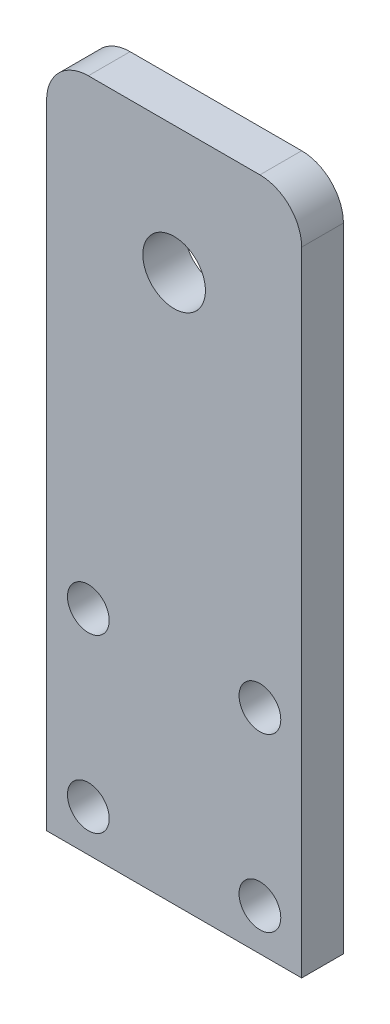
ISO-10303-21;
HEADER;
FILE_DESCRIPTION(('STEP AP214'),'2;1');
FILE_NAME('part.step','',(''),(''),'','','');
FILE_SCHEMA(('AUTOMOTIVE_DESIGN { 1 0 10303 214 1 1 1 1 }'));
ENDSEC;
DATA;
#1=APPLICATION_CONTEXT('core data for automotive mechanical design processes');
#2=APPLICATION_PROTOCOL_DEFINITION('international standard','automotive_design',2000,#1);
#3=PRODUCT_CONTEXT('',#1,'mechanical');
#4=PRODUCT('Part','Part','',(#3));
#5=PRODUCT_RELATED_PRODUCT_CATEGORY('part','',(#4));
#6=PRODUCT_DEFINITION_FORMATION('','',#4);
#7=PRODUCT_DEFINITION_CONTEXT('part definition',#1,'design');
#8=PRODUCT_DEFINITION('design','',#6,#7);
#9=PRODUCT_DEFINITION_SHAPE('','',#8);
#10=(LENGTH_UNIT() NAMED_UNIT(*) SI_UNIT(.MILLI.,.METRE.));
#11=(NAMED_UNIT(*) PLANE_ANGLE_UNIT() SI_UNIT($,.RADIAN.));
#12=(NAMED_UNIT(*) SI_UNIT($,.STERADIAN.) SOLID_ANGLE_UNIT());
#13=UNCERTAINTY_MEASURE_WITH_UNIT(LENGTH_MEASURE(1.E-05),#10,'distance_accuracy_value','');
#14=(GEOMETRIC_REPRESENTATION_CONTEXT(3) GLOBAL_UNCERTAINTY_ASSIGNED_CONTEXT((#13)) GLOBAL_UNIT_ASSIGNED_CONTEXT((#10,
#11,#12)) REPRESENTATION_CONTEXT('',''));
#15=CARTESIAN_POINT('',(0.,0.,0.));
#16=DIRECTION('',(0.,0.,1.));
#17=DIRECTION('',(1.,0.,0.));
#18=AXIS2_PLACEMENT_3D('',#15,#16,#17);
#19=CARTESIAN_POINT('',(-19.4005200000629,0.,6.35));
#20=DIRECTION('',(1.,0.,0.));
#21=DIRECTION('',(0.,1.,0.));
#22=AXIS2_PLACEMENT_3D('',#19,#20,#21);
#23=PLANE('',#22);
#24=DIRECTION('',(0.,-1.,0.));
#25=VECTOR('',#24,1.);
#26=CARTESIAN_POINT('',(-19.4005200000629,0.,6.35));
#27=LINE('',#26,#25);
#28=CARTESIAN_POINT('',(-19.400520000063,76.8901025000322,6.35));
#29=VERTEX_POINT('',#28);
#30=CARTESIAN_POINT('',(-19.4005200000002,-19.4005200000001,6.35));
#31=VERTEX_POINT('',#30);
#32=EDGE_CURVE('E90',#29,#31,#27,.T.);
#33=ORIENTED_EDGE('',*,*,#32,.F.);
#34=DIRECTION('',(0.,0.,-1.));
#35=VECTOR('',#34,1.);
#36=CARTESIAN_POINT('',(-19.400520000063,76.8901025000322,6.35));
#37=LINE('',#36,#35);
#38=CARTESIAN_POINT('',(-19.400520000063,76.8901025000322,0.));
#39=VERTEX_POINT('',#38);
#40=EDGE_CURVE('E115',#29,#39,#37,.T.);
#41=ORIENTED_EDGE('',*,*,#40,.T.);
#42=DIRECTION('',(0.,-1.,0.));
#43=VECTOR('',#42,1.);
#44=CARTESIAN_POINT('',(-19.4005200000629,0.,0.));
#45=LINE('',#44,#43);
#46=CARTESIAN_POINT('',(-19.4005200000002,-19.4005200000001,0.));
#47=VERTEX_POINT('',#46);
#48=EDGE_CURVE('E113',#39,#47,#45,.T.);
#49=ORIENTED_EDGE('',*,*,#48,.T.);
#50=DIRECTION('',(0.,0.,-1.));
#51=VECTOR('',#50,1.);
#52=CARTESIAN_POINT('',(-19.4005200000002,-19.4005200000001,6.35));
#53=LINE('',#52,#51);
#54=EDGE_CURVE('E107',#31,#47,#53,.T.);
#55=ORIENTED_EDGE('',*,*,#54,.F.);
#56=EDGE_LOOP('',(#33,#41,#49,#55));
#57=FACE_BOUND('',#56,.T.);
#58=ADVANCED_FACE('F36',(#57),#23,.F.);
#59=CARTESIAN_POINT('',(1.38777878078143E-13,-19.40052,6.35));
#60=DIRECTION('',(0.,1.,0.));
#61=DIRECTION('',(-1.,0.,0.));
#62=AXIS2_PLACEMENT_3D('',#59,#60,#61);
#63=PLANE('',#62);
#64=DIRECTION('',(1.,0.,0.));
#65=VECTOR('',#64,1.);
#66=CARTESIAN_POINT('',(1.38777878078143E-13,-19.40052,0.));
#67=LINE('',#66,#65);
#68=CARTESIAN_POINT('',(19.4005200000002,-19.4005199999999,0.));
#69=VERTEX_POINT('',#68);
#70=EDGE_CURVE('E145',#47,#69,#67,.T.);
#71=ORIENTED_EDGE('',*,*,#70,.T.);
#72=DIRECTION('',(0.,0.,-1.));
#73=VECTOR('',#72,1.);
#74=CARTESIAN_POINT('',(19.4005200000002,-19.4005199999999,6.35));
#75=LINE('',#74,#73);
#76=CARTESIAN_POINT('',(19.4005200000002,-19.4005199999999,6.35));
#77=VERTEX_POINT('',#76);
#78=EDGE_CURVE('E109',#77,#69,#75,.T.);
#79=ORIENTED_EDGE('',*,*,#78,.F.);
#80=DIRECTION('',(1.,0.,0.));
#81=VECTOR('',#80,1.);
#82=CARTESIAN_POINT('',(1.38777878078143E-13,-19.40052,6.35));
#83=LINE('',#82,#81);
#84=EDGE_CURVE('E94',#31,#77,#83,.T.);
#85=ORIENTED_EDGE('',*,*,#84,.F.);
#86=ORIENTED_EDGE('',*,*,#54,.T.);
#87=EDGE_LOOP('',(#71,#79,#85,#86));
#88=FACE_BOUND('',#87,.T.);
#89=ADVANCED_FACE('F106',(#88),#63,.F.);
#90=CARTESIAN_POINT('',(19.4005199999995,0.,6.35));
#91=DIRECTION('',(1.,0.,0.));
#92=DIRECTION('',(0.,1.,0.));
#93=AXIS2_PLACEMENT_3D('',#90,#91,#92);
#94=PLANE('',#93);
#95=DIRECTION('',(0.,-1.,0.));
#96=VECTOR('',#95,1.);
#97=CARTESIAN_POINT('',(19.4005199999995,0.,0.));
#98=LINE('',#97,#96);
#99=CARTESIAN_POINT('',(19.4005199999995,76.8901025000322,0.));
#100=VERTEX_POINT('',#99);
#101=EDGE_CURVE('E142',#100,#69,#98,.T.);
#102=ORIENTED_EDGE('',*,*,#101,.F.);
#103=DIRECTION('',(0.,0.,-1.));
#104=VECTOR('',#103,1.);
#105=CARTESIAN_POINT('',(19.4005199999995,76.8901025000322,6.35));
#106=LINE('',#105,#104);
#107=CARTESIAN_POINT('',(19.4005199999995,76.8901025000322,6.35));
#108=VERTEX_POINT('',#107);
#109=EDGE_CURVE('E11',#100,#108,#106,.F.);
#110=ORIENTED_EDGE('',*,*,#109,.T.);
#111=DIRECTION('',(0.,-1.,0.));
#112=VECTOR('',#111,1.);
#113=CARTESIAN_POINT('',(19.4005199999995,0.,6.35));
#114=LINE('',#113,#112);
#115=EDGE_CURVE('E110',#108,#77,#114,.T.);
#116=ORIENTED_EDGE('',*,*,#115,.T.);
#117=ORIENTED_EDGE('',*,*,#78,.T.);
#118=EDGE_LOOP('',(#102,#110,#116,#117));
#119=FACE_BOUND('',#118,.T.);
#120=ADVANCED_FACE('F144',(#119),#94,.T.);
#121=CARTESIAN_POINT('',(-13.0505200000002,13.05052,6.35));
#122=DIRECTION('',(0.,0.,-1.));
#123=DIRECTION('',(-1.,0.,0.));
#124=AXIS2_PLACEMENT_3D('',#121,#122,#123);
#125=CYLINDRICAL_SURFACE('',#124,3.175);
#126=CARTESIAN_POINT('',(-13.0505200000002,13.05052,6.35));
#127=DIRECTION('',(0.,0.,1.));
#128=DIRECTION('',(1.,0.,0.));
#129=AXIS2_PLACEMENT_3D('',#126,#127,#128);
#130=CIRCLE('',#129,3.175);
#131=CARTESIAN_POINT('',(-9.87552000000018,13.05052,6.35));
#132=VERTEX_POINT('',#131);
#133=EDGE_CURVE('E196',#132,#132,#130,.T.);
#134=ORIENTED_EDGE('',*,*,#133,.T.);
#135=EDGE_LOOP('',(#134));
#136=FACE_BOUND('',#135,.T.);
#137=CARTESIAN_POINT('',(-13.0505200000002,13.05052,0.));
#138=DIRECTION('',(0.,0.,1.));
#139=DIRECTION('',(1.,0.,0.));
#140=AXIS2_PLACEMENT_3D('',#137,#138,#139);
#141=CIRCLE('',#140,3.175);
#142=CARTESIAN_POINT('',(-9.87552000000018,13.05052,0.));
#143=VERTEX_POINT('',#142);
#144=EDGE_CURVE('E160',#143,#143,#141,.T.);
#145=ORIENTED_EDGE('',*,*,#144,.F.);
#146=EDGE_LOOP('',(#145));
#147=FACE_BOUND('',#146,.T.);
#148=ADVANCED_FACE('F219',(#136,#147),#125,.F.);
#149=CARTESIAN_POINT('',(-13.0505199999993,-13.0505199999992,6.35));
#150=DIRECTION('',(0.,0.,-1.));
#151=DIRECTION('',(-1.,0.,0.));
#152=AXIS2_PLACEMENT_3D('',#149,#150,#151);
#153=CYLINDRICAL_SURFACE('',#152,3.17499999999884);
#154=CARTESIAN_POINT('',(-13.0505199999993,-13.0505199999992,6.35));
#155=DIRECTION('',(0.,0.,1.));
#156=DIRECTION('',(1.,0.,0.));
#157=AXIS2_PLACEMENT_3D('',#154,#155,#156);
#158=CIRCLE('',#157,3.17499999999884);
#159=CARTESIAN_POINT('',(-9.87552000000051,-13.0505199999992,6.35));
#160=VERTEX_POINT('',#159);
#161=EDGE_CURVE('E199',#160,#160,#158,.T.);
#162=ORIENTED_EDGE('',*,*,#161,.T.);
#163=EDGE_LOOP('',(#162));
#164=FACE_BOUND('',#163,.T.);
#165=CARTESIAN_POINT('',(-13.0505199999993,-13.0505199999992,0.));
#166=DIRECTION('',(0.,0.,1.));
#167=DIRECTION('',(1.,0.,0.));
#168=AXIS2_PLACEMENT_3D('',#165,#166,#167);
#169=CIRCLE('',#168,3.17499999999884);
#170=CARTESIAN_POINT('',(-9.87552000000051,-13.0505199999992,0.));
#171=VERTEX_POINT('',#170);
#172=EDGE_CURVE('E157',#171,#171,#169,.T.);
#173=ORIENTED_EDGE('',*,*,#172,.F.);
#174=EDGE_LOOP('',(#173));
#175=FACE_BOUND('',#174,.T.);
#176=ADVANCED_FACE('F222',(#164,#175),#153,.F.);
#177=CARTESIAN_POINT('',(13.0505199999994,-13.0505199999992,6.35));
#178=DIRECTION('',(0.,0.,-1.));
#179=DIRECTION('',(-1.,0.,0.));
#180=AXIS2_PLACEMENT_3D('',#177,#178,#179);
#181=CYLINDRICAL_SURFACE('',#180,3.17500000000024);
#182=CARTESIAN_POINT('',(13.0505199999994,-13.0505199999992,6.35));
#183=DIRECTION('',(0.,0.,1.));
#184=DIRECTION('',(1.,0.,0.));
#185=AXIS2_PLACEMENT_3D('',#182,#183,#184);
#186=CIRCLE('',#185,3.17500000000024);
#187=CARTESIAN_POINT('',(16.2255199999997,-13.0505199999992,6.35));
#188=VERTEX_POINT('',#187);
#189=EDGE_CURVE('E202',#188,#188,#186,.T.);
#190=ORIENTED_EDGE('',*,*,#189,.T.);
#191=EDGE_LOOP('',(#190));
#192=FACE_BOUND('',#191,.T.);
#193=CARTESIAN_POINT('',(13.0505199999994,-13.0505199999992,0.));
#194=DIRECTION('',(0.,0.,1.));
#195=DIRECTION('',(1.,0.,0.));
#196=AXIS2_PLACEMENT_3D('',#193,#194,#195);
#197=CIRCLE('',#196,3.17500000000024);
#198=CARTESIAN_POINT('',(16.2255199999997,-13.0505199999992,0.));
#199=VERTEX_POINT('',#198);
#200=EDGE_CURVE('E154',#199,#199,#197,.T.);
#201=ORIENTED_EDGE('',*,*,#200,.F.);
#202=EDGE_LOOP('',(#201));
#203=FACE_BOUND('',#202,.T.);
#204=ADVANCED_FACE('F229',(#192,#203),#181,.F.);
#205=CARTESIAN_POINT('',(-3.17020715234761E-11,63.8395825000009,6.35));
#206=DIRECTION('',(0.,0.,-1.));
#207=DIRECTION('',(-1.,0.,0.));
#208=AXIS2_PLACEMENT_3D('',#205,#206,#207);
#209=CYLINDRICAL_SURFACE('',#208,4.76250000000179);
#210=CARTESIAN_POINT('',(-3.17020715234761E-11,63.8395825000009,6.35));
#211=DIRECTION('',(0.,0.,1.));
#212=DIRECTION('',(1.,0.,0.));
#213=AXIS2_PLACEMENT_3D('',#210,#211,#212);
#214=CIRCLE('',#213,4.76250000000179);
#215=CARTESIAN_POINT('',(4.76249999997009,63.8395825000009,6.35));
#216=VERTEX_POINT('',#215);
#217=EDGE_CURVE('E137',#216,#216,#214,.T.);
#218=ORIENTED_EDGE('',*,*,#217,.T.);
#219=EDGE_LOOP('',(#218));
#220=FACE_BOUND('',#219,.T.);
#221=CARTESIAN_POINT('',(-3.17020715234761E-11,63.8395825000009,0.));
#222=DIRECTION('',(0.,0.,1.));
#223=DIRECTION('',(1.,0.,0.));
#224=AXIS2_PLACEMENT_3D('',#221,#222,#223);
#225=CIRCLE('',#224,4.76250000000179);
#226=CARTESIAN_POINT('',(4.76249999997009,63.8395825000009,0.));
#227=VERTEX_POINT('',#226);
#228=EDGE_CURVE('E147',#227,#227,#225,.T.);
#229=ORIENTED_EDGE('',*,*,#228,.F.);
#230=EDGE_LOOP('',(#229));
#231=FACE_BOUND('',#230,.T.);
#232=ADVANCED_FACE('F175',(#220,#231),#209,.F.);
#233=CARTESIAN_POINT('',(0.,83.2401025000322,6.35));
#234=DIRECTION('',(0.,-1.,0.));
#235=DIRECTION('',(0.,0.,-1.));
#236=AXIS2_PLACEMENT_3D('',#233,#234,#235);
#237=PLANE('',#236);
#238=DIRECTION('',(-1.,0.,0.));
#239=VECTOR('',#238,1.);
#240=CARTESIAN_POINT('',(0.,83.2401025000322,0.));
#241=LINE('',#240,#239);
#242=CARTESIAN_POINT('',(13.0505199999995,83.2401025000322,0.));
#243=VERTEX_POINT('',#242);
#244=CARTESIAN_POINT('',(-13.050520000063,83.2401025000322,0.));
#245=VERTEX_POINT('',#244);
#246=EDGE_CURVE('E143',#243,#245,#241,.T.);
#247=ORIENTED_EDGE('',*,*,#246,.T.);
#248=DIRECTION('',(0.,0.,-1.));
#249=VECTOR('',#248,1.);
#250=CARTESIAN_POINT('',(-13.050520000063,83.2401025000322,6.35));
#251=LINE('',#250,#249);
#252=CARTESIAN_POINT('',(-13.050520000063,83.2401025000322,6.35));
#253=VERTEX_POINT('',#252);
#254=EDGE_CURVE('E57',#245,#253,#251,.F.);
#255=ORIENTED_EDGE('',*,*,#254,.T.);
#256=DIRECTION('',(-1.,0.,0.));
#257=VECTOR('',#256,1.);
#258=CARTESIAN_POINT('',(0.,83.2401025000322,6.35));
#259=LINE('',#258,#257);
#260=CARTESIAN_POINT('',(13.0505199999995,83.2401025000322,6.35));
#261=VERTEX_POINT('',#260);
#262=EDGE_CURVE('E132',#261,#253,#259,.T.);
#263=ORIENTED_EDGE('',*,*,#262,.F.);
#264=DIRECTION('',(0.,0.,-1.));
#265=VECTOR('',#264,1.);
#266=CARTESIAN_POINT('',(13.0505199999995,83.2401025000322,0.));
#267=LINE('',#266,#265);
#268=EDGE_CURVE('E126',#261,#243,#267,.T.);
#269=ORIENTED_EDGE('',*,*,#268,.T.);
#270=EDGE_LOOP('',(#247,#255,#263,#269));
#271=FACE_BOUND('',#270,.T.);
#272=ADVANCED_FACE('F135',(#271),#237,.F.);
#273=CARTESIAN_POINT('',(13.0505199999994,13.05052,6.35));
#274=DIRECTION('',(0.,0.,-1.));
#275=DIRECTION('',(-1.,0.,0.));
#276=AXIS2_PLACEMENT_3D('',#273,#274,#275);
#277=CYLINDRICAL_SURFACE('',#276,3.17500000000054);
#278=CARTESIAN_POINT('',(13.0505199999994,13.05052,6.35));
#279=DIRECTION('',(0.,0.,1.));
#280=DIRECTION('',(1.,0.,0.));
#281=AXIS2_PLACEMENT_3D('',#278,#279,#280);
#282=CIRCLE('',#281,3.17500000000054);
#283=CARTESIAN_POINT('',(16.22552,13.05052,6.35));
#284=VERTEX_POINT('',#283);
#285=EDGE_CURVE('E119',#284,#284,#282,.T.);
#286=ORIENTED_EDGE('',*,*,#285,.T.);
#287=EDGE_LOOP('',(#286));
#288=FACE_BOUND('',#287,.T.);
#289=CARTESIAN_POINT('',(13.0505199999994,13.05052,0.));
#290=DIRECTION('',(0.,0.,1.));
#291=DIRECTION('',(1.,0.,0.));
#292=AXIS2_PLACEMENT_3D('',#289,#290,#291);
#293=CIRCLE('',#292,3.17500000000054);
#294=CARTESIAN_POINT('',(16.22552,13.05052,0.));
#295=VERTEX_POINT('',#294);
#296=EDGE_CURVE('E101',#295,#295,#293,.T.);
#297=ORIENTED_EDGE('',*,*,#296,.F.);
#298=EDGE_LOOP('',(#297));
#299=FACE_BOUND('',#298,.T.);
#300=ADVANCED_FACE('F166',(#288,#299),#277,.F.);
#301=CARTESIAN_POINT('',(0.,0.,6.35));
#302=DIRECTION('',(0.,0.,1.));
#303=DIRECTION('',(1.,0.,0.));
#304=AXIS2_PLACEMENT_3D('',#301,#302,#303);
#305=PLANE('',#304);
#306=ORIENTED_EDGE('',*,*,#262,.T.);
#307=CARTESIAN_POINT('',(-13.050520000063,76.8901025000322,6.35));
#308=DIRECTION('',(0.,0.,1.));
#309=DIRECTION('',(1.,0.,0.));
#310=AXIS2_PLACEMENT_3D('',#307,#308,#309);
#311=CIRCLE('',#310,6.35);
#312=EDGE_CURVE('E44',#253,#29,#311,.T.);
#313=ORIENTED_EDGE('',*,*,#312,.T.);
#314=ORIENTED_EDGE('',*,*,#32,.T.);
#315=ORIENTED_EDGE('',*,*,#84,.T.);
#316=ORIENTED_EDGE('',*,*,#115,.F.);
#317=CARTESIAN_POINT('',(13.0505199999995,76.8901025000322,6.35));
#318=DIRECTION('',(0.,0.,1.));
#319=DIRECTION('',(1.,0.,0.));
#320=AXIS2_PLACEMENT_3D('',#317,#318,#319);
#321=CIRCLE('',#320,6.35);
#322=EDGE_CURVE('E130',#108,#261,#321,.T.);
#323=ORIENTED_EDGE('',*,*,#322,.T.);
#324=EDGE_LOOP('',(#306,#313,#314,#315,#316,#323));
#325=FACE_BOUND('',#324,.T.);
#326=ORIENTED_EDGE('',*,*,#217,.F.);
#327=EDGE_LOOP('',(#326));
#328=FACE_BOUND('',#327,.T.);
#329=ORIENTED_EDGE('',*,*,#189,.F.);
#330=EDGE_LOOP('',(#329));
#331=FACE_BOUND('',#330,.T.);
#332=ORIENTED_EDGE('',*,*,#161,.F.);
#333=EDGE_LOOP('',(#332));
#334=FACE_BOUND('',#333,.T.);
#335=ORIENTED_EDGE('',*,*,#133,.F.);
#336=EDGE_LOOP('',(#335));
#337=FACE_BOUND('',#336,.T.);
#338=ORIENTED_EDGE('',*,*,#285,.F.);
#339=EDGE_LOOP('',(#338));
#340=FACE_BOUND('',#339,.T.);
#341=ADVANCED_FACE('F92',(#325,#328,#331,#334,#337,#340),#305,.T.);
#342=CARTESIAN_POINT('',(0.,0.,0.));
#343=DIRECTION('',(0.,0.,1.));
#344=DIRECTION('',(1.,0.,0.));
#345=AXIS2_PLACEMENT_3D('',#342,#343,#344);
#346=PLANE('',#345);
#347=ORIENTED_EDGE('',*,*,#48,.F.);
#348=CARTESIAN_POINT('',(-13.050520000063,76.8901025000322,0.));
#349=DIRECTION('',(0.,0.,1.));
#350=DIRECTION('',(1.,0.,0.));
#351=AXIS2_PLACEMENT_3D('',#348,#349,#350);
#352=CIRCLE('',#351,6.35);
#353=EDGE_CURVE('E124',#39,#245,#352,.F.);
#354=ORIENTED_EDGE('',*,*,#353,.T.);
#355=ORIENTED_EDGE('',*,*,#246,.F.);
#356=CARTESIAN_POINT('',(13.0505199999995,76.8901025000322,0.));
#357=DIRECTION('',(0.,0.,1.));
#358=DIRECTION('',(1.,0.,0.));
#359=AXIS2_PLACEMENT_3D('',#356,#357,#358);
#360=CIRCLE('',#359,6.35);
#361=EDGE_CURVE('E117',#243,#100,#360,.F.);
#362=ORIENTED_EDGE('',*,*,#361,.T.);
#363=ORIENTED_EDGE('',*,*,#101,.T.);
#364=ORIENTED_EDGE('',*,*,#70,.F.);
#365=EDGE_LOOP('',(#347,#354,#355,#362,#363,#364));
#366=FACE_BOUND('',#365,.T.);
#367=ORIENTED_EDGE('',*,*,#228,.T.);
#368=EDGE_LOOP('',(#367));
#369=FACE_BOUND('',#368,.T.);
#370=ORIENTED_EDGE('',*,*,#200,.T.);
#371=EDGE_LOOP('',(#370));
#372=FACE_BOUND('',#371,.T.);
#373=ORIENTED_EDGE('',*,*,#172,.T.);
#374=EDGE_LOOP('',(#373));
#375=FACE_BOUND('',#374,.T.);
#376=ORIENTED_EDGE('',*,*,#144,.T.);
#377=EDGE_LOOP('',(#376));
#378=FACE_BOUND('',#377,.T.);
#379=ORIENTED_EDGE('',*,*,#296,.T.);
#380=EDGE_LOOP('',(#379));
#381=FACE_BOUND('',#380,.T.);
#382=ADVANCED_FACE('F140',(#366,#369,#372,#375,#378,#381),#346,.F.);
#383=CARTESIAN_POINT('',(-13.050520000063,76.8901025000322,6.35));
#384=DIRECTION('',(0.,0.,-1.));
#385=DIRECTION('',(-1.,0.,0.));
#386=AXIS2_PLACEMENT_3D('',#383,#384,#385);
#387=CYLINDRICAL_SURFACE('',#386,6.35);
#388=ORIENTED_EDGE('',*,*,#312,.F.);
#389=ORIENTED_EDGE('',*,*,#254,.F.);
#390=ORIENTED_EDGE('',*,*,#353,.F.);
#391=ORIENTED_EDGE('',*,*,#40,.F.);
#392=EDGE_LOOP('',(#388,#389,#390,#391));
#393=FACE_BOUND('',#392,.T.);
#394=ADVANCED_FACE('F187',(#393),#387,.T.);
#395=CARTESIAN_POINT('',(13.0505199999995,76.8901025000322,6.35));
#396=DIRECTION('',(0.,0.,1.));
#397=DIRECTION('',(1.,0.,0.));
#398=AXIS2_PLACEMENT_3D('',#395,#396,#397);
#399=CYLINDRICAL_SURFACE('',#398,6.35);
#400=ORIENTED_EDGE('',*,*,#322,.F.);
#401=ORIENTED_EDGE('',*,*,#109,.F.);
#402=ORIENTED_EDGE('',*,*,#361,.F.);
#403=ORIENTED_EDGE('',*,*,#268,.F.);
#404=EDGE_LOOP('',(#400,#401,#402,#403));
#405=FACE_BOUND('',#404,.T.);
#406=ADVANCED_FACE('F38',(#405),#399,.T.);
#407=CLOSED_SHELL('',(#58,#89,#120,#148,#176,#204,#232,#272,#300,#341,#382,#394,#406));
#408=MANIFOLD_SOLID_BREP('B2',#407);
#409=ADVANCED_BREP_SHAPE_REPRESENTATION('',(#18,#408),#14);
#410=SHAPE_DEFINITION_REPRESENTATION(#9,#409);
ENDSEC;
END-ISO-10303-21;
